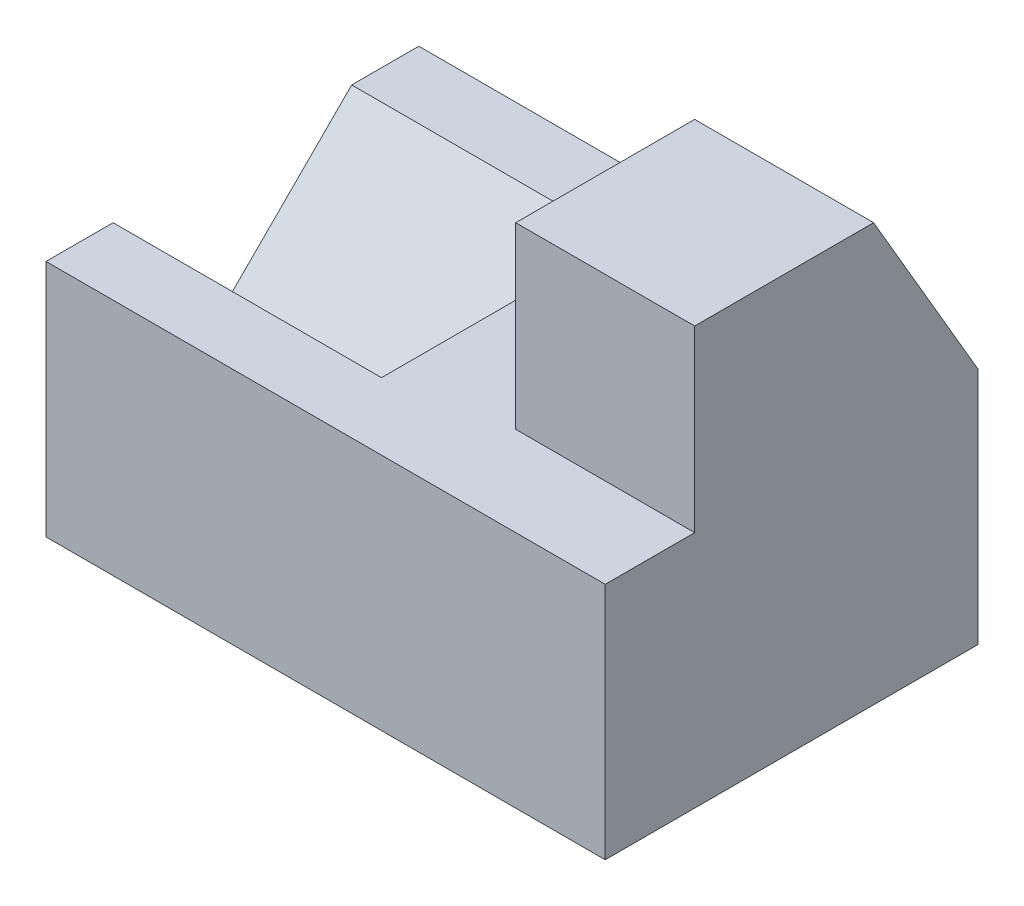
ISO-10303-21;
HEADER;
FILE_DESCRIPTION(('STEP AP214'),'2;1');
FILE_NAME('part.step','',(''),(''),'','','');
FILE_SCHEMA(('AUTOMOTIVE_DESIGN { 1 0 10303 214 1 1 1 1 }'));
ENDSEC;
DATA;
#1=APPLICATION_CONTEXT('core data for automotive mechanical design processes');
#2=APPLICATION_PROTOCOL_DEFINITION('international standard','automotive_design',2000,#1);
#3=PRODUCT_CONTEXT('',#1,'mechanical');
#4=PRODUCT('Part','Part','',(#3));
#5=PRODUCT_RELATED_PRODUCT_CATEGORY('part','',(#4));
#6=PRODUCT_DEFINITION_FORMATION('','',#4);
#7=PRODUCT_DEFINITION_CONTEXT('part definition',#1,'design');
#8=PRODUCT_DEFINITION('design','',#6,#7);
#9=PRODUCT_DEFINITION_SHAPE('','',#8);
#10=(LENGTH_UNIT() NAMED_UNIT(*) SI_UNIT(.MILLI.,.METRE.));
#11=(NAMED_UNIT(*) PLANE_ANGLE_UNIT() SI_UNIT($,.RADIAN.));
#12=(NAMED_UNIT(*) SI_UNIT($,.STERADIAN.) SOLID_ANGLE_UNIT());
#13=UNCERTAINTY_MEASURE_WITH_UNIT(LENGTH_MEASURE(1.E-05),#10,'distance_accuracy_value','');
#14=(GEOMETRIC_REPRESENTATION_CONTEXT(3) GLOBAL_UNCERTAINTY_ASSIGNED_CONTEXT((#13)) GLOBAL_UNIT_ASSIGNED_CONTEXT((#10,
#11,#12)) REPRESENTATION_CONTEXT('',''));
#15=CARTESIAN_POINT('',(0.,0.,0.));
#16=DIRECTION('',(0.,0.,1.));
#17=DIRECTION('',(1.,0.,0.));
#18=AXIS2_PLACEMENT_3D('',#15,#16,#17);
#19=CARTESIAN_POINT('',(0.,32.,0.));
#20=DIRECTION('',(0.,1.,0.));
#21=DIRECTION('',(0.,0.,1.));
#22=AXIS2_PLACEMENT_3D('',#19,#20,#21);
#23=PLANE('',#22);
#24=DIRECTION('',(0.,0.,1.));
#25=VECTOR('',#24,1.);
#26=CARTESIAN_POINT('',(15.3120393094278,32.,12.122417874183));
#27=LINE('',#26,#25);
#28=CARTESIAN_POINT('',(15.3120393094278,32.,-25.877582125817));
#29=VERTEX_POINT('',#28);
#30=CARTESIAN_POINT('',(15.3120393094278,32.,12.122417874183));
#31=VERTEX_POINT('',#30);
#32=EDGE_CURVE('E109',#29,#31,#27,.T.);
#33=ORIENTED_EDGE('',*,*,#32,.F.);
#34=DIRECTION('',(1.,0.,0.));
#35=VECTOR('',#34,1.);
#36=CARTESIAN_POINT('',(-35.6879606905722,32.,-25.877582125817));
#37=LINE('',#36,#35);
#38=CARTESIAN_POINT('',(-35.6879606905722,32.,-25.877582125817));
#39=VERTEX_POINT('',#38);
#40=EDGE_CURVE('E113',#39,#29,#37,.T.);
#41=ORIENTED_EDGE('',*,*,#40,.F.);
#42=DIRECTION('',(0.,0.,1.));
#43=VECTOR('',#42,1.);
#44=CARTESIAN_POINT('',(-35.6879606905722,32.,-25.877582125817));
#45=LINE('',#44,#43);
#46=CARTESIAN_POINT('',(-35.6879606905722,32.,-16.877582125817));
#47=VERTEX_POINT('',#46);
#48=EDGE_CURVE('E210',#39,#47,#45,.T.);
#49=ORIENTED_EDGE('',*,*,#48,.T.);
#50=DIRECTION('',(-1.,0.,0.));
#51=VECTOR('',#50,1.);
#52=CARTESIAN_POINT('',(0.312039309427824,32.,-16.877582125817));
#53=LINE('',#52,#51);
#54=CARTESIAN_POINT('',(0.312039309427824,32.,-16.877582125817));
#55=VERTEX_POINT('',#54);
#56=EDGE_CURVE('E201',#55,#47,#53,.T.);
#57=ORIENTED_EDGE('',*,*,#56,.F.);
#58=DIRECTION('',(0.,0.,-1.));
#59=VECTOR('',#58,1.);
#60=CARTESIAN_POINT('',(0.312039309427824,32.,15.122417874183));
#61=LINE('',#60,#59);
#62=CARTESIAN_POINT('',(0.312039309427824,32.,15.122417874183));
#63=VERTEX_POINT('',#62);
#64=EDGE_CURVE('E192',#63,#55,#61,.T.);
#65=ORIENTED_EDGE('',*,*,#64,.F.);
#66=DIRECTION('',(-1.,0.,0.));
#67=VECTOR('',#66,1.);
#68=CARTESIAN_POINT('',(0.312039309427824,32.,15.122417874183));
#69=LINE('',#68,#67);
#70=CARTESIAN_POINT('',(-35.6879606905722,32.,15.122417874183));
#71=VERTEX_POINT('',#70);
#72=EDGE_CURVE('E149',#63,#71,#69,.T.);
#73=ORIENTED_EDGE('',*,*,#72,.T.);
#74=CARTESIAN_POINT('',(-35.6879606905722,32.,24.122417874183));
#75=VERTEX_POINT('',#74);
#76=EDGE_CURVE('E157',#71,#75,#45,.T.);
#77=ORIENTED_EDGE('',*,*,#76,.T.);
#78=DIRECTION('',(1.,0.,0.));
#79=VECTOR('',#78,1.);
#80=CARTESIAN_POINT('',(-35.6879606905722,32.,24.122417874183));
#81=LINE('',#80,#79);
#82=CARTESIAN_POINT('',(39.3120393094278,32.,24.122417874183));
#83=VERTEX_POINT('',#82);
#84=EDGE_CURVE('E141',#75,#83,#81,.T.);
#85=ORIENTED_EDGE('',*,*,#84,.T.);
#86=DIRECTION('',(0.,0.,1.));
#87=VECTOR('',#86,1.);
#88=CARTESIAN_POINT('',(39.3120393094278,32.,-25.877582125817));
#89=LINE('',#88,#87);
#90=CARTESIAN_POINT('',(39.3120393094278,32.,12.122417874183));
#91=VERTEX_POINT('',#90);
#92=EDGE_CURVE('E53',#91,#83,#89,.T.);
#93=ORIENTED_EDGE('',*,*,#92,.F.);
#94=DIRECTION('',(1.,0.,0.));
#95=VECTOR('',#94,1.);
#96=CARTESIAN_POINT('',(39.3120393094278,32.,12.122417874183));
#97=LINE('',#96,#95);
#98=EDGE_CURVE('E48',#31,#91,#97,.T.);
#99=ORIENTED_EDGE('',*,*,#98,.F.);
#100=EDGE_LOOP('',(#33,#41,#49,#57,#65,#73,#77,#85,#93,#99));
#101=FACE_BOUND('',#100,.T.);
#102=ADVANCED_FACE('F33',(#101),#23,.T.);
#103=CARTESIAN_POINT('',(-35.6879606905722,32.,-25.877582125817));
#104=DIRECTION('',(1.,0.,0.));
#105=DIRECTION('',(0.,0.,-1.));
#106=AXIS2_PLACEMENT_3D('',#103,#104,#105);
#107=PLANE('',#106);
#108=ORIENTED_EDGE('',*,*,#76,.F.);
#109=DIRECTION('',(0.,0.707106781186548,0.707106781186548));
#110=VECTOR('',#109,1.);
#111=CARTESIAN_POINT('',(-35.6879606905722,16.,-0.877582125816963));
#112=LINE('',#111,#110);
#113=CARTESIAN_POINT('',(-35.6879606905722,16.,-0.877582125816963));
#114=VERTEX_POINT('',#113);
#115=EDGE_CURVE('E196',#114,#71,#112,.T.);
#116=ORIENTED_EDGE('',*,*,#115,.F.);
#117=DIRECTION('',(0.,-0.707106781186548,0.707106781186548));
#118=VECTOR('',#117,1.);
#119=CARTESIAN_POINT('',(-35.6879606905722,32.,-16.877582125817));
#120=LINE('',#119,#118);
#121=EDGE_CURVE('E191',#47,#114,#120,.T.);
#122=ORIENTED_EDGE('',*,*,#121,.F.);
#123=ORIENTED_EDGE('',*,*,#48,.F.);
#124=DIRECTION('',(0.,-1.,0.));
#125=VECTOR('',#124,1.);
#126=CARTESIAN_POINT('',(-35.6879606905722,32.,-25.877582125817));
#127=LINE('',#126,#125);
#128=CARTESIAN_POINT('',(-35.6879606905722,0.,-25.877582125817));
#129=VERTEX_POINT('',#128);
#130=EDGE_CURVE('E136',#39,#129,#127,.T.);
#131=ORIENTED_EDGE('',*,*,#130,.T.);
#132=DIRECTION('',(0.,0.,1.));
#133=VECTOR('',#132,1.);
#134=CARTESIAN_POINT('',(-35.6879606905722,0.,-25.877582125817));
#135=LINE('',#134,#133);
#136=CARTESIAN_POINT('',(-35.6879606905722,0.,24.122417874183));
#137=VERTEX_POINT('',#136);
#138=EDGE_CURVE('E145',#129,#137,#135,.T.);
#139=ORIENTED_EDGE('',*,*,#138,.T.);
#140=DIRECTION('',(0.,-1.,0.));
#141=VECTOR('',#140,1.);
#142=CARTESIAN_POINT('',(-35.6879606905722,32.,24.122417874183));
#143=LINE('',#142,#141);
#144=EDGE_CURVE('E11',#75,#137,#143,.T.);
#145=ORIENTED_EDGE('',*,*,#144,.F.);
#146=EDGE_LOOP('',(#108,#116,#122,#123,#131,#139,#145));
#147=FACE_BOUND('',#146,.T.);
#148=ADVANCED_FACE('F35',(#147),#107,.F.);
#149=CARTESIAN_POINT('',(-35.6879606905722,32.,24.122417874183));
#150=DIRECTION('',(0.,0.,-1.));
#151=DIRECTION('',(-1.,0.,0.));
#152=AXIS2_PLACEMENT_3D('',#149,#150,#151);
#153=PLANE('',#152);
#154=DIRECTION('',(1.,0.,0.));
#155=VECTOR('',#154,1.);
#156=CARTESIAN_POINT('',(-35.6879606905722,0.,24.122417874183));
#157=LINE('',#156,#155);
#158=CARTESIAN_POINT('',(39.3120393094278,0.,24.122417874183));
#159=VERTEX_POINT('',#158);
#160=EDGE_CURVE('E148',#137,#159,#157,.T.);
#161=ORIENTED_EDGE('',*,*,#160,.T.);
#162=DIRECTION('',(0.,-1.,0.));
#163=VECTOR('',#162,1.);
#164=CARTESIAN_POINT('',(39.3120393094278,32.,24.122417874183));
#165=LINE('',#164,#163);
#166=EDGE_CURVE('E41',#83,#159,#165,.T.);
#167=ORIENTED_EDGE('',*,*,#166,.F.);
#168=ORIENTED_EDGE('',*,*,#84,.F.);
#169=ORIENTED_EDGE('',*,*,#144,.T.);
#170=EDGE_LOOP('',(#161,#167,#168,#169));
#171=FACE_BOUND('',#170,.T.);
#172=ADVANCED_FACE('F166',(#171),#153,.F.);
#173=CARTESIAN_POINT('',(39.3120393094278,32.,-25.877582125817));
#174=DIRECTION('',(1.,0.,0.));
#175=DIRECTION('',(0.,0.,-1.));
#176=AXIS2_PLACEMENT_3D('',#173,#174,#175);
#177=PLANE('',#176);
#178=DIRECTION('',(0.,0.,1.));
#179=VECTOR('',#178,1.);
#180=CARTESIAN_POINT('',(39.3120393094278,0.,-25.877582125817));
#181=LINE('',#180,#179);
#182=CARTESIAN_POINT('',(39.3120393094278,0.,-25.877582125817));
#183=VERTEX_POINT('',#182);
#184=EDGE_CURVE('E152',#183,#159,#181,.T.);
#185=ORIENTED_EDGE('',*,*,#184,.F.);
#186=DIRECTION('',(0.,-1.,0.));
#187=VECTOR('',#186,1.);
#188=CARTESIAN_POINT('',(39.3120393094278,32.,-25.877582125817));
#189=LINE('',#188,#187);
#190=CARTESIAN_POINT('',(39.3120393094278,32.,-25.877582125817));
#191=VERTEX_POINT('',#190);
#192=EDGE_CURVE('E139',#191,#183,#189,.T.);
#193=ORIENTED_EDGE('',*,*,#192,.F.);
#194=DIRECTION('',(0.,0.863778900898433,0.503871025524086));
#195=VECTOR('',#194,1.);
#196=CARTESIAN_POINT('',(39.3120393094278,56.,-11.877582125817));
#197=LINE('',#196,#195);
#198=CARTESIAN_POINT('',(39.3120393094278,56.,-11.877582125817));
#199=VERTEX_POINT('',#198);
#200=EDGE_CURVE('E126',#191,#199,#197,.T.);
#201=ORIENTED_EDGE('',*,*,#200,.T.);
#202=DIRECTION('',(0.,0.,-1.));
#203=VECTOR('',#202,1.);
#204=CARTESIAN_POINT('',(39.3120393094278,56.,12.122417874183));
#205=LINE('',#204,#203);
#206=CARTESIAN_POINT('',(39.3120393094278,56.,12.122417874183));
#207=VERTEX_POINT('',#206);
#208=EDGE_CURVE('E173',#207,#199,#205,.T.);
#209=ORIENTED_EDGE('',*,*,#208,.F.);
#210=DIRECTION('',(0.,-1.,0.));
#211=VECTOR('',#210,1.);
#212=CARTESIAN_POINT('',(39.3120393094278,56.,12.122417874183));
#213=LINE('',#212,#211);
#214=EDGE_CURVE('E186',#207,#91,#213,.T.);
#215=ORIENTED_EDGE('',*,*,#214,.T.);
#216=ORIENTED_EDGE('',*,*,#92,.T.);
#217=ORIENTED_EDGE('',*,*,#166,.T.);
#218=EDGE_LOOP('',(#185,#193,#201,#209,#215,#216,#217));
#219=FACE_BOUND('',#218,.T.);
#220=ADVANCED_FACE('F162',(#219),#177,.T.);
#221=CARTESIAN_POINT('',(-35.6879606905722,32.,-25.877582125817));
#222=DIRECTION('',(0.,0.,-1.));
#223=DIRECTION('',(-1.,0.,0.));
#224=AXIS2_PLACEMENT_3D('',#221,#222,#223);
#225=PLANE('',#224);
#226=DIRECTION('',(1.,0.,0.));
#227=VECTOR('',#226,1.);
#228=CARTESIAN_POINT('',(-35.6879606905722,0.,-25.877582125817));
#229=LINE('',#228,#227);
#230=EDGE_CURVE('E155',#129,#183,#229,.T.);
#231=ORIENTED_EDGE('',*,*,#230,.F.);
#232=ORIENTED_EDGE('',*,*,#130,.F.);
#233=ORIENTED_EDGE('',*,*,#40,.T.);
#234=DIRECTION('',(1.,0.,0.));
#235=VECTOR('',#234,1.);
#236=CARTESIAN_POINT('',(15.3120393094278,32.,-25.877582125817));
#237=LINE('',#236,#235);
#238=EDGE_CURVE('E118',#29,#191,#237,.T.);
#239=ORIENTED_EDGE('',*,*,#238,.T.);
#240=ORIENTED_EDGE('',*,*,#192,.T.);
#241=EDGE_LOOP('',(#231,#232,#233,#239,#240));
#242=FACE_BOUND('',#241,.T.);
#243=ADVANCED_FACE('F135',(#242),#225,.T.);
#244=CARTESIAN_POINT('',(0.,0.,0.));
#245=DIRECTION('',(0.,1.,0.));
#246=DIRECTION('',(0.,0.,1.));
#247=AXIS2_PLACEMENT_3D('',#244,#245,#246);
#248=PLANE('',#247);
#249=ORIENTED_EDGE('',*,*,#138,.F.);
#250=ORIENTED_EDGE('',*,*,#230,.T.);
#251=ORIENTED_EDGE('',*,*,#184,.T.);
#252=ORIENTED_EDGE('',*,*,#160,.F.);
#253=EDGE_LOOP('',(#249,#250,#251,#252));
#254=FACE_BOUND('',#253,.T.);
#255=ADVANCED_FACE('F170',(#254),#248,.F.);
#256=CARTESIAN_POINT('',(0.312039309427824,16.,-0.877582125816963));
#257=DIRECTION('',(0.,-0.707106781186547,0.707106781186547));
#258=DIRECTION('',(0.,-0.707106781186548,-0.707106781186548));
#259=AXIS2_PLACEMENT_3D('',#256,#257,#258);
#260=PLANE('',#259);
#261=ORIENTED_EDGE('',*,*,#115,.T.);
#262=ORIENTED_EDGE('',*,*,#72,.F.);
#263=DIRECTION('',(0.,0.707106781186548,0.707106781186548));
#264=VECTOR('',#263,1.);
#265=CARTESIAN_POINT('',(0.312039309427824,16.,-0.877582125816963));
#266=LINE('',#265,#264);
#267=CARTESIAN_POINT('',(0.312039309427824,16.,-0.877582125816963));
#268=VERTEX_POINT('',#267);
#269=EDGE_CURVE('E199',#268,#63,#266,.T.);
#270=ORIENTED_EDGE('',*,*,#269,.F.);
#271=DIRECTION('',(-1.,0.,0.));
#272=VECTOR('',#271,1.);
#273=CARTESIAN_POINT('',(0.312039309427824,16.,-0.877582125816963));
#274=LINE('',#273,#272);
#275=EDGE_CURVE('E207',#268,#114,#274,.T.);
#276=ORIENTED_EDGE('',*,*,#275,.T.);
#277=EDGE_LOOP('',(#261,#262,#270,#276));
#278=FACE_BOUND('',#277,.T.);
#279=ADVANCED_FACE('F224',(#278),#260,.F.);
#280=CARTESIAN_POINT('',(0.312039309427824,32.,-16.877582125817));
#281=DIRECTION('',(0.,-0.707106781186547,-0.707106781186547));
#282=DIRECTION('',(0.,0.707106781186548,-0.707106781186548));
#283=AXIS2_PLACEMENT_3D('',#280,#281,#282);
#284=PLANE('',#283);
#285=ORIENTED_EDGE('',*,*,#121,.T.);
#286=ORIENTED_EDGE('',*,*,#275,.F.);
#287=DIRECTION('',(0.,-0.707106781186548,0.707106781186548));
#288=VECTOR('',#287,1.);
#289=CARTESIAN_POINT('',(0.312039309427824,32.,-16.877582125817));
#290=LINE('',#289,#288);
#291=EDGE_CURVE('E195',#55,#268,#290,.T.);
#292=ORIENTED_EDGE('',*,*,#291,.F.);
#293=ORIENTED_EDGE('',*,*,#56,.T.);
#294=EDGE_LOOP('',(#285,#286,#292,#293));
#295=FACE_BOUND('',#294,.T.);
#296=ADVANCED_FACE('F218',(#295),#284,.F.);
#297=CARTESIAN_POINT('',(0.312039309427824,0.,0.));
#298=DIRECTION('',(-1.,0.,0.));
#299=DIRECTION('',(0.,0.,1.));
#300=AXIS2_PLACEMENT_3D('',#297,#298,#299);
#301=PLANE('',#300);
#302=ORIENTED_EDGE('',*,*,#64,.T.);
#303=ORIENTED_EDGE('',*,*,#291,.T.);
#304=ORIENTED_EDGE('',*,*,#269,.T.);
#305=EDGE_LOOP('',(#302,#303,#304));
#306=FACE_BOUND('',#305,.T.);
#307=ADVANCED_FACE('F221',(#306),#301,.T.);
#308=CARTESIAN_POINT('',(15.3120393094278,56.,12.122417874183));
#309=DIRECTION('',(1.,0.,0.));
#310=DIRECTION('',(0.,0.,-1.));
#311=AXIS2_PLACEMENT_3D('',#308,#309,#310);
#312=PLANE('',#311);
#313=ORIENTED_EDGE('',*,*,#32,.T.);
#314=DIRECTION('',(0.,-1.,0.));
#315=VECTOR('',#314,1.);
#316=CARTESIAN_POINT('',(15.3120393094278,56.,12.122417874183));
#317=LINE('',#316,#315);
#318=CARTESIAN_POINT('',(15.3120393094278,56.,12.122417874183));
#319=VERTEX_POINT('',#318);
#320=EDGE_CURVE('E189',#319,#31,#317,.T.);
#321=ORIENTED_EDGE('',*,*,#320,.F.);
#322=DIRECTION('',(0.,0.,1.));
#323=VECTOR('',#322,1.);
#324=CARTESIAN_POINT('',(15.3120393094278,56.,12.122417874183));
#325=LINE('',#324,#323);
#326=CARTESIAN_POINT('',(15.3120393094278,56.,-11.877582125817));
#327=VERTEX_POINT('',#326);
#328=EDGE_CURVE('E132',#327,#319,#325,.T.);
#329=ORIENTED_EDGE('',*,*,#328,.F.);
#330=DIRECTION('',(0.,0.863778900898433,0.503871025524086));
#331=VECTOR('',#330,1.);
#332=CARTESIAN_POINT('',(15.3120393094278,56.,-11.877582125817));
#333=LINE('',#332,#331);
#334=EDGE_CURVE('E123',#29,#327,#333,.T.);
#335=ORIENTED_EDGE('',*,*,#334,.F.);
#336=EDGE_LOOP('',(#313,#321,#329,#335));
#337=FACE_BOUND('',#336,.T.);
#338=ADVANCED_FACE('F131',(#337),#312,.F.);
#339=CARTESIAN_POINT('',(39.3120393094278,56.,12.122417874183));
#340=DIRECTION('',(0.,0.,-1.));
#341=DIRECTION('',(-1.,0.,0.));
#342=AXIS2_PLACEMENT_3D('',#339,#340,#341);
#343=PLANE('',#342);
#344=ORIENTED_EDGE('',*,*,#98,.T.);
#345=ORIENTED_EDGE('',*,*,#214,.F.);
#346=DIRECTION('',(1.,0.,0.));
#347=VECTOR('',#346,1.);
#348=CARTESIAN_POINT('',(39.3120393094278,56.,12.122417874183));
#349=LINE('',#348,#347);
#350=EDGE_CURVE('E179',#319,#207,#349,.T.);
#351=ORIENTED_EDGE('',*,*,#350,.F.);
#352=ORIENTED_EDGE('',*,*,#320,.T.);
#353=EDGE_LOOP('',(#344,#345,#351,#352));
#354=FACE_BOUND('',#353,.T.);
#355=ADVANCED_FACE('F289',(#354),#343,.F.);
#356=CARTESIAN_POINT('',(0.,56.,0.));
#357=DIRECTION('',(0.,1.,0.));
#358=DIRECTION('',(0.,0.,1.));
#359=AXIS2_PLACEMENT_3D('',#356,#357,#358);
#360=PLANE('',#359);
#361=ORIENTED_EDGE('',*,*,#208,.T.);
#362=DIRECTION('',(-1.,0.,0.));
#363=VECTOR('',#362,1.);
#364=CARTESIAN_POINT('',(39.3120393094278,56.,-11.877582125817));
#365=LINE('',#364,#363);
#366=EDGE_CURVE('E177',#199,#327,#365,.T.);
#367=ORIENTED_EDGE('',*,*,#366,.T.);
#368=ORIENTED_EDGE('',*,*,#328,.T.);
#369=ORIENTED_EDGE('',*,*,#350,.T.);
#370=EDGE_LOOP('',(#361,#367,#368,#369));
#371=FACE_BOUND('',#370,.T.);
#372=ADVANCED_FACE('F176',(#371),#360,.T.);
#373=CARTESIAN_POINT('',(15.3120393094278,56.,-11.877582125817));
#374=DIRECTION('',(0.,0.503871025524086,-0.863778900898433));
#375=DIRECTION('',(0.,0.863778900898433,0.503871025524086));
#376=AXIS2_PLACEMENT_3D('',#373,#374,#375);
#377=PLANE('',#376);
#378=ORIENTED_EDGE('',*,*,#200,.F.);
#379=ORIENTED_EDGE('',*,*,#238,.F.);
#380=ORIENTED_EDGE('',*,*,#334,.T.);
#381=ORIENTED_EDGE('',*,*,#366,.F.);
#382=EDGE_LOOP('',(#378,#379,#380,#381));
#383=FACE_BOUND('',#382,.T.);
#384=ADVANCED_FACE('F122',(#383),#377,.T.);
#385=CLOSED_SHELL('',(#102,#148,#172,#220,#243,#255,#279,#296,#307,#338,#355,#372,#384));
#386=MANIFOLD_SOLID_BREP('B2',#385);
#387=ADVANCED_BREP_SHAPE_REPRESENTATION('',(#18,#386),#14);
#388=SHAPE_DEFINITION_REPRESENTATION(#9,#387);
ENDSEC;
END-ISO-10303-21;
